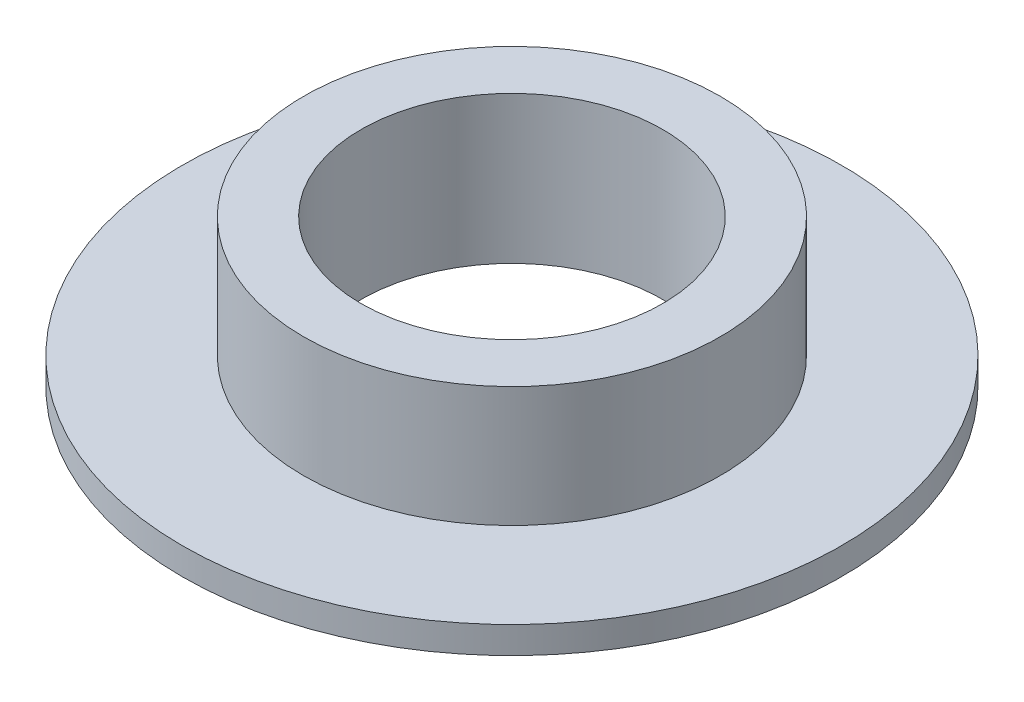
ISO-10303-21;
HEADER;
FILE_DESCRIPTION(('STEP AP214'),'2;1');
FILE_NAME('part.step','',(''),(''),'','','');
FILE_SCHEMA(('AUTOMOTIVE_DESIGN { 1 0 10303 214 1 1 1 1 }'));
ENDSEC;
DATA;
#1=APPLICATION_CONTEXT('core data for automotive mechanical design processes');
#2=APPLICATION_PROTOCOL_DEFINITION('international standard','automotive_design',2000,#1);
#3=PRODUCT_CONTEXT('',#1,'mechanical');
#4=PRODUCT('Part','Part','',(#3));
#5=PRODUCT_RELATED_PRODUCT_CATEGORY('part','',(#4));
#6=PRODUCT_DEFINITION_FORMATION('','',#4);
#7=PRODUCT_DEFINITION_CONTEXT('part definition',#1,'design');
#8=PRODUCT_DEFINITION('design','',#6,#7);
#9=PRODUCT_DEFINITION_SHAPE('','',#8);
#10=(LENGTH_UNIT() NAMED_UNIT(*) SI_UNIT(.MILLI.,.METRE.));
#11=(NAMED_UNIT(*) PLANE_ANGLE_UNIT() SI_UNIT($,.RADIAN.));
#12=(NAMED_UNIT(*) SI_UNIT($,.STERADIAN.) SOLID_ANGLE_UNIT());
#13=UNCERTAINTY_MEASURE_WITH_UNIT(LENGTH_MEASURE(1.E-05),#10,'distance_accuracy_value','');
#14=(GEOMETRIC_REPRESENTATION_CONTEXT(3) GLOBAL_UNCERTAINTY_ASSIGNED_CONTEXT((#13)) GLOBAL_UNIT_ASSIGNED_CONTEXT((#10,
#11,#12)) REPRESENTATION_CONTEXT('',''));
#15=CARTESIAN_POINT('',(0.,0.,0.));
#16=DIRECTION('',(0.,0.,1.));
#17=DIRECTION('',(1.,0.,0.));
#18=AXIS2_PLACEMENT_3D('',#15,#16,#17);
#19=CARTESIAN_POINT('',(0.,1.905,0.));
#20=DIRECTION('',(0.,-1.,0.));
#21=DIRECTION('',(0.,0.,-1.));
#22=AXIS2_PLACEMENT_3D('',#19,#20,#21);
#23=CYLINDRICAL_SURFACE('',#22,23.3045);
#24=CARTESIAN_POINT('',(0.,1.905,0.));
#25=DIRECTION('',(0.,1.,0.));
#26=DIRECTION('',(0.,0.,1.));
#27=AXIS2_PLACEMENT_3D('',#24,#25,#26);
#28=CIRCLE('',#27,23.3045);
#29=CARTESIAN_POINT('',(0.,1.905,23.3045));
#30=VERTEX_POINT('',#29);
#31=EDGE_CURVE('E10',#30,#30,#28,.T.);
#32=ORIENTED_EDGE('',*,*,#31,.F.);
#33=EDGE_LOOP('',(#32));
#34=FACE_BOUND('',#33,.T.);
#35=CARTESIAN_POINT('',(0.,0.,0.));
#36=DIRECTION('',(0.,1.,0.));
#37=DIRECTION('',(0.,0.,1.));
#38=AXIS2_PLACEMENT_3D('',#35,#36,#37);
#39=CIRCLE('',#38,23.3045);
#40=CARTESIAN_POINT('',(0.,0.,23.3045));
#41=VERTEX_POINT('',#40);
#42=EDGE_CURVE('E43',#41,#41,#39,.T.);
#43=ORIENTED_EDGE('',*,*,#42,.T.);
#44=EDGE_LOOP('',(#43));
#45=FACE_BOUND('',#44,.T.);
#46=ADVANCED_FACE('F32',(#34,#45),#23,.T.);
#47=CARTESIAN_POINT('',(0.,1.905,0.));
#48=DIRECTION('',(0.,-1.,0.));
#49=DIRECTION('',(0.,0.,-1.));
#50=AXIS2_PLACEMENT_3D('',#47,#48,#49);
#51=CYLINDRICAL_SURFACE('',#50,10.668);
#52=CARTESIAN_POINT('',(0.,0.,0.));
#53=DIRECTION('',(0.,1.,0.));
#54=DIRECTION('',(0.,0.,1.));
#55=AXIS2_PLACEMENT_3D('',#52,#53,#54);
#56=CIRCLE('',#55,10.668);
#57=CARTESIAN_POINT('',(0.,0.,10.668));
#58=VERTEX_POINT('',#57);
#59=EDGE_CURVE('E35',#58,#58,#56,.T.);
#60=ORIENTED_EDGE('',*,*,#59,.F.);
#61=EDGE_LOOP('',(#60));
#62=FACE_BOUND('',#61,.T.);
#63=CARTESIAN_POINT('',(0.,10.414,0.));
#64=DIRECTION('',(0.,1.,0.));
#65=DIRECTION('',(0.,0.,1.));
#66=AXIS2_PLACEMENT_3D('',#63,#64,#65);
#67=CIRCLE('',#66,10.668);
#68=CARTESIAN_POINT('',(0.,10.414,10.668));
#69=VERTEX_POINT('',#68);
#70=EDGE_CURVE('E55',#69,#69,#67,.T.);
#71=ORIENTED_EDGE('',*,*,#70,.T.);
#72=EDGE_LOOP('',(#71));
#73=FACE_BOUND('',#72,.T.);
#74=ADVANCED_FACE('F62',(#62,#73),#51,.F.);
#75=CARTESIAN_POINT('',(0.,1.905,0.));
#76=DIRECTION('',(0.,1.,0.));
#77=DIRECTION('',(0.,0.,1.));
#78=AXIS2_PLACEMENT_3D('',#75,#76,#77);
#79=PLANE('',#78);
#80=CARTESIAN_POINT('',(0.,1.905,0.));
#81=DIRECTION('',(0.,1.,0.));
#82=DIRECTION('',(0.,0.,1.));
#83=AXIS2_PLACEMENT_3D('',#80,#81,#82);
#84=CIRCLE('',#83,14.732);
#85=CARTESIAN_POINT('',(0.,1.905,14.732));
#86=VERTEX_POINT('',#85);
#87=EDGE_CURVE('E45',#86,#86,#84,.F.);
#88=ORIENTED_EDGE('',*,*,#87,.T.);
#89=EDGE_LOOP('',(#88));
#90=FACE_BOUND('',#89,.T.);
#91=ORIENTED_EDGE('',*,*,#31,.T.);
#92=EDGE_LOOP('',(#91));
#93=FACE_BOUND('',#92,.T.);
#94=ADVANCED_FACE('F79',(#90,#93),#79,.T.);
#95=CARTESIAN_POINT('',(0.,0.,0.));
#96=DIRECTION('',(0.,1.,0.));
#97=DIRECTION('',(0.,0.,1.));
#98=AXIS2_PLACEMENT_3D('',#95,#96,#97);
#99=PLANE('',#98);
#100=ORIENTED_EDGE('',*,*,#42,.F.);
#101=EDGE_LOOP('',(#100));
#102=FACE_BOUND('',#101,.T.);
#103=ORIENTED_EDGE('',*,*,#59,.T.);
#104=EDGE_LOOP('',(#103));
#105=FACE_BOUND('',#104,.T.);
#106=ADVANCED_FACE('F71',(#102,#105),#99,.F.);
#107=CARTESIAN_POINT('',(0.,10.414,0.));
#108=DIRECTION('',(0.,-1.,0.));
#109=DIRECTION('',(0.,0.,-1.));
#110=AXIS2_PLACEMENT_3D('',#107,#108,#109);
#111=CYLINDRICAL_SURFACE('',#110,14.732);
#112=ORIENTED_EDGE('',*,*,#87,.F.);
#113=EDGE_LOOP('',(#112));
#114=FACE_BOUND('',#113,.T.);
#115=CARTESIAN_POINT('',(0.,10.414,0.));
#116=DIRECTION('',(0.,1.,0.));
#117=DIRECTION('',(0.,0.,1.));
#118=AXIS2_PLACEMENT_3D('',#115,#116,#117);
#119=CIRCLE('',#118,14.732);
#120=CARTESIAN_POINT('',(0.,10.414,14.732));
#121=VERTEX_POINT('',#120);
#122=EDGE_CURVE('E51',#121,#121,#119,.T.);
#123=ORIENTED_EDGE('',*,*,#122,.F.);
#124=EDGE_LOOP('',(#123));
#125=FACE_BOUND('',#124,.T.);
#126=ADVANCED_FACE('F66',(#114,#125),#111,.T.);
#127=CARTESIAN_POINT('',(0.,10.414,0.));
#128=DIRECTION('',(0.,1.,0.));
#129=DIRECTION('',(0.,0.,1.));
#130=AXIS2_PLACEMENT_3D('',#127,#128,#129);
#131=PLANE('',#130);
#132=ORIENTED_EDGE('',*,*,#70,.F.);
#133=EDGE_LOOP('',(#132));
#134=FACE_BOUND('',#133,.T.);
#135=ORIENTED_EDGE('',*,*,#122,.T.);
#136=EDGE_LOOP('',(#135));
#137=FACE_BOUND('',#136,.T.);
#138=ADVANCED_FACE('F64',(#134,#137),#131,.T.);
#139=CLOSED_SHELL('',(#46,#74,#94,#106,#126,#138));
#140=MANIFOLD_SOLID_BREP('B2',#139);
#141=ADVANCED_BREP_SHAPE_REPRESENTATION('',(#18,#140),#14);
#142=SHAPE_DEFINITION_REPRESENTATION(#9,#141);
ENDSEC;
END-ISO-10303-21;
